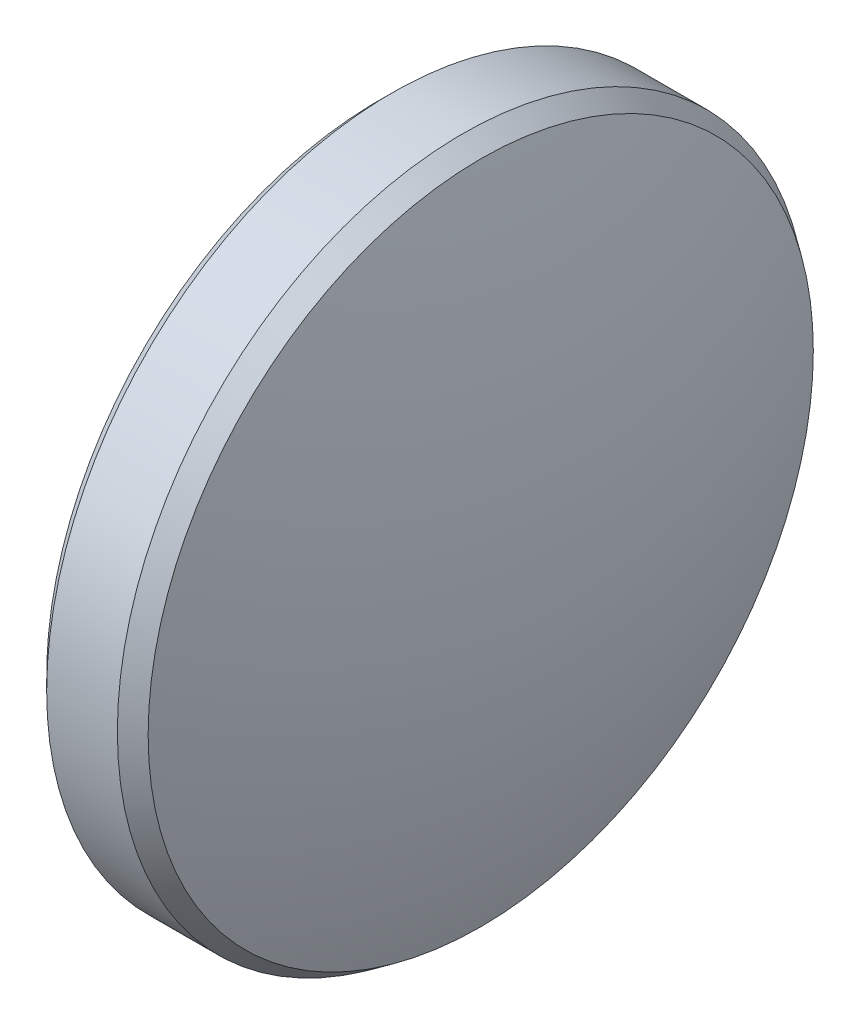
ISO-10303-21;
HEADER;
FILE_DESCRIPTION(('STEP AP214'),'2;1');
FILE_NAME('part.step','',(''),(''),'','','');
FILE_SCHEMA(('AUTOMOTIVE_DESIGN { 1 0 10303 214 1 1 1 1 }'));
ENDSEC;
DATA;
#1=APPLICATION_CONTEXT('core data for automotive mechanical design processes');
#2=APPLICATION_PROTOCOL_DEFINITION('international standard','automotive_design',2000,#1);
#3=PRODUCT_CONTEXT('',#1,'mechanical');
#4=PRODUCT('Part','Part','',(#3));
#5=PRODUCT_RELATED_PRODUCT_CATEGORY('part','',(#4));
#6=PRODUCT_DEFINITION_FORMATION('','',#4);
#7=PRODUCT_DEFINITION_CONTEXT('part definition',#1,'design');
#8=PRODUCT_DEFINITION('design','',#6,#7);
#9=PRODUCT_DEFINITION_SHAPE('','',#8);
#10=(LENGTH_UNIT() NAMED_UNIT(*) SI_UNIT(.MILLI.,.METRE.));
#11=(NAMED_UNIT(*) PLANE_ANGLE_UNIT() SI_UNIT($,.RADIAN.));
#12=(NAMED_UNIT(*) SI_UNIT($,.STERADIAN.) SOLID_ANGLE_UNIT());
#13=UNCERTAINTY_MEASURE_WITH_UNIT(LENGTH_MEASURE(1.E-05),#10,'distance_accuracy_value','');
#14=(GEOMETRIC_REPRESENTATION_CONTEXT(3) GLOBAL_UNCERTAINTY_ASSIGNED_CONTEXT((#13)) GLOBAL_UNIT_ASSIGNED_CONTEXT((#10,
#11,#12)) REPRESENTATION_CONTEXT('',''));
#15=CARTESIAN_POINT('',(0.,0.,0.));
#16=DIRECTION('',(0.,0.,1.));
#17=DIRECTION('',(1.,0.,0.));
#18=AXIS2_PLACEMENT_3D('',#15,#16,#17);
#19=CARTESIAN_POINT('',(-1.45,0.,0.));
#20=DIRECTION('',(1.,0.,0.));
#21=DIRECTION('',(0.,0.,-1.));
#22=AXIS2_PLACEMENT_3D('',#19,#20,#21);
#23=PLANE('',#22);
#24=CARTESIAN_POINT('',(-1.45,0.,0.));
#25=DIRECTION('',(1.,0.,0.));
#26=DIRECTION('',(0.,0.,-1.));
#27=AXIS2_PLACEMENT_3D('',#24,#25,#26);
#28=CIRCLE('',#27,6.1);
#29=CARTESIAN_POINT('',(-1.45,0.,-6.1));
#30=VERTEX_POINT('',#29);
#31=EDGE_CURVE('E10',#30,#30,#28,.F.);
#32=ORIENTED_EDGE('',*,*,#31,.T.);
#33=EDGE_LOOP('',(#32));
#34=FACE_BOUND('',#33,.T.);
#35=ADVANCED_FACE('F15',(#34),#23,.F.);
#36=CARTESIAN_POINT('',(-1.45,0.,0.));
#37=DIRECTION('',(-1.,0.,0.));
#38=DIRECTION('',(0.,0.,1.));
#39=AXIS2_PLACEMENT_3D('',#36,#37,#38);
#40=CYLINDRICAL_SURFACE('',#39,6.35);
#41=CARTESIAN_POINT('',(0.0999999999999994,0.,0.));
#42=DIRECTION('',(-1.,0.,0.));
#43=DIRECTION('',(0.,0.,1.));
#44=AXIS2_PLACEMENT_3D('',#41,#42,#43);
#45=CIRCLE('',#44,6.35);
#46=CARTESIAN_POINT('',(0.0999999999999994,0.,6.35));
#47=VERTEX_POINT('',#46);
#48=EDGE_CURVE('E55',#47,#47,#45,.T.);
#49=ORIENTED_EDGE('',*,*,#48,.T.);
#50=EDGE_LOOP('',(#49));
#51=FACE_BOUND('',#50,.T.);
#52=CARTESIAN_POINT('',(-1.2,0.,0.));
#53=DIRECTION('',(1.,0.,0.));
#54=DIRECTION('',(0.,0.,-1.));
#55=AXIS2_PLACEMENT_3D('',#52,#53,#54);
#56=CIRCLE('',#55,6.35);
#57=CARTESIAN_POINT('',(-1.2,0.,-6.35));
#58=VERTEX_POINT('',#57);
#59=EDGE_CURVE('E53',#58,#58,#56,.T.);
#60=ORIENTED_EDGE('',*,*,#59,.T.);
#61=EDGE_LOOP('',(#60));
#62=FACE_BOUND('',#61,.T.);
#63=ADVANCED_FACE('F28',(#51,#62),#40,.T.);
#64=CARTESIAN_POINT('',(-16.9498132200735,0.,0.0829063713258418));
#65=DIRECTION('',(0.,-1.,0.));
#66=DIRECTION('',(0.,0.,1.));
#67=AXIS2_PLACEMENT_3D('',#64,#65,#66);
#68=CIRCLE('',#67,18.4);
#69=TRIMMED_CURVE('',#68,(PARAMETER_VALUE(-1.57530212309146)),
(PARAMETER_VALUE(1.57530212309146)),.T.,.PARAMETER.);
#70=CARTESIAN_POINT('',(-16.9498132200735,0.,0.));
#71=DIRECTION('',(-1.,0.,0.));
#72=AXIS1_PLACEMENT('',#70,#71);
#73=SURFACE_OF_REVOLUTION('',#69,#72);
#74=CARTESIAN_POINT('',(0.432774796028258,0.,0.));
#75=DIRECTION('',(-1.,0.,0.));
#76=DIRECTION('',(0.,0.,1.));
#77=AXIS2_PLACEMENT_3D('',#74,#75,#76);
#78=CIRCLE('',#77,6.11661450666629);
#79=CARTESIAN_POINT('',(0.432774796028258,0.,6.11661450666629));
#80=VERTEX_POINT('',#79);
#81=EDGE_CURVE('E22',#80,#80,#78,.F.);
#82=ORIENTED_EDGE('',*,*,#81,.T.);
#83=EDGE_LOOP('',(#82));
#84=FACE_BOUND('',#83,.T.);
#85=CARTESIAN_POINT('',(1.45,0.,0.));
#86=VERTEX_POINT('',#85);
#87=VERTEX_LOOP('',#86);
#88=FACE_BOUND('',#87,.T.);
#89=ADVANCED_FACE('F25',(#84,#88),#73,.T.);
#90=CARTESIAN_POINT('',(0.0999999999999994,0.,0.));
#91=DIRECTION('',(-1.,0.,0.));
#92=DIRECTION('',(0.,0.,1.));
#93=AXIS2_PLACEMENT_3D('',#90,#91,#92);
#94=CONICAL_SURFACE('',#93,6.35,0.611619123277054);
#95=ORIENTED_EDGE('',*,*,#81,.F.);
#96=EDGE_LOOP('',(#95));
#97=FACE_BOUND('',#96,.T.);
#98=ORIENTED_EDGE('',*,*,#48,.F.);
#99=EDGE_LOOP('',(#98));
#100=FACE_BOUND('',#99,.T.);
#101=ADVANCED_FACE('F27',(#97,#100),#94,.T.);
#102=CARTESIAN_POINT('',(-1.45,0.,0.));
#103=DIRECTION('',(1.,0.,0.));
#104=DIRECTION('',(0.,0.,-1.));
#105=AXIS2_PLACEMENT_3D('',#102,#103,#104);
#106=CONICAL_SURFACE('',#105,6.1,0.785398163397447);
#107=ORIENTED_EDGE('',*,*,#59,.F.);
#108=EDGE_LOOP('',(#107));
#109=FACE_BOUND('',#108,.T.);
#110=ORIENTED_EDGE('',*,*,#31,.F.);
#111=EDGE_LOOP('',(#110));
#112=FACE_BOUND('',#111,.T.);
#113=ADVANCED_FACE('F17',(#109,#112),#106,.T.);
#114=CLOSED_SHELL('',(#35,#63,#89,#101,#113));
#115=MANIFOLD_SOLID_BREP('B1',#114);
#116=ADVANCED_BREP_SHAPE_REPRESENTATION('',(#18,#115),#14);
#117=SHAPE_DEFINITION_REPRESENTATION(#9,#116);
ENDSEC;
END-ISO-10303-21;
